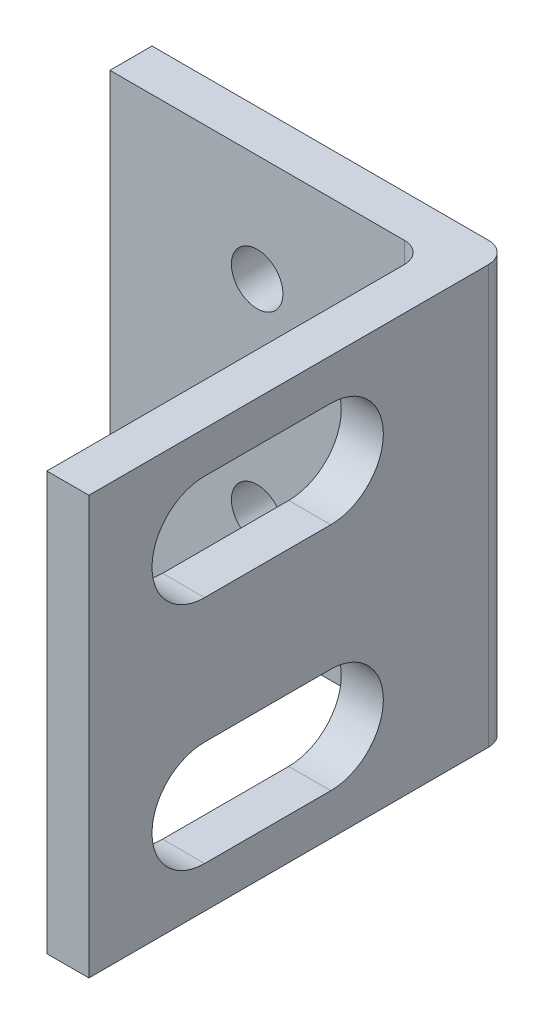
ISO-10303-21;
HEADER;
FILE_DESCRIPTION(('STEP AP214'),'2;1');
FILE_NAME('part.step','',(''),(''),'','','');
FILE_SCHEMA(('AUTOMOTIVE_DESIGN { 1 0 10303 214 1 1 1 1 }'));
ENDSEC;
DATA;
#1=APPLICATION_CONTEXT('core data for automotive mechanical design processes');
#2=APPLICATION_PROTOCOL_DEFINITION('international standard','automotive_design',2000,#1);
#3=PRODUCT_CONTEXT('',#1,'mechanical');
#4=PRODUCT('Part','Part','',(#3));
#5=PRODUCT_RELATED_PRODUCT_CATEGORY('part','',(#4));
#6=PRODUCT_DEFINITION_FORMATION('','',#4);
#7=PRODUCT_DEFINITION_CONTEXT('part definition',#1,'design');
#8=PRODUCT_DEFINITION('design','',#6,#7);
#9=PRODUCT_DEFINITION_SHAPE('','',#8);
#10=(LENGTH_UNIT() NAMED_UNIT(*) SI_UNIT(.MILLI.,.METRE.));
#11=(NAMED_UNIT(*) PLANE_ANGLE_UNIT() SI_UNIT($,.RADIAN.));
#12=(NAMED_UNIT(*) SI_UNIT($,.STERADIAN.) SOLID_ANGLE_UNIT());
#13=UNCERTAINTY_MEASURE_WITH_UNIT(LENGTH_MEASURE(1.E-05),#10,'distance_accuracy_value','');
#14=(GEOMETRIC_REPRESENTATION_CONTEXT(3) GLOBAL_UNCERTAINTY_ASSIGNED_CONTEXT((#13)) GLOBAL_UNIT_ASSIGNED_CONTEXT((#10,
#11,#12)) REPRESENTATION_CONTEXT('',''));
#15=CARTESIAN_POINT('',(0.,0.,0.));
#16=DIRECTION('',(0.,0.,1.));
#17=DIRECTION('',(1.,0.,0.));
#18=AXIS2_PLACEMENT_3D('',#15,#16,#17);
#19=CARTESIAN_POINT('',(1.31162466780544,19.88,0.));
#20=DIRECTION('',(1.,0.,0.));
#21=DIRECTION('',(0.,0.,-1.));
#22=AXIS2_PLACEMENT_3D('',#19,#20,#21);
#23=PLANE('',#22);
#24=CARTESIAN_POINT('',(1.31162466780544,15.4153869381785,-3.84005449659987));
#25=DIRECTION('',(-1.,0.,0.));
#26=DIRECTION('',(0.,0.,1.));
#27=AXIS2_PLACEMENT_3D('',#24,#25,#26);
#28=CIRCLE('',#27,2.5);
#29=CARTESIAN_POINT('',(1.31162466780544,17.9153869381785,-3.84005449659987));
#30=VERTEX_POINT('',#29);
#31=CARTESIAN_POINT('',(1.31162466780544,12.9153869381785,-3.84005449659987));
#32=VERTEX_POINT('',#31);
#33=EDGE_CURVE('E152',#30,#32,#28,.T.);
#34=ORIENTED_EDGE('',*,*,#33,.T.);
#35=DIRECTION('',(0.,0.,1.));
#36=VECTOR('',#35,1.);
#37=CARTESIAN_POINT('',(1.31162466780544,12.9153869381785,0.));
#38=LINE('',#37,#36);
#39=CARTESIAN_POINT('',(1.31162466780544,12.9153869381785,2.15994550340013));
#40=VERTEX_POINT('',#39);
#41=EDGE_CURVE('E163',#32,#40,#38,.T.);
#42=ORIENTED_EDGE('',*,*,#41,.T.);
#43=CARTESIAN_POINT('',(1.31162466780544,15.4153869381785,2.15994550340013));
#44=DIRECTION('',(-1.,0.,0.));
#45=DIRECTION('',(0.,0.,1.));
#46=AXIS2_PLACEMENT_3D('',#43,#44,#45);
#47=CIRCLE('',#46,2.5);
#48=CARTESIAN_POINT('',(1.31162466780544,17.9153869381785,2.15994550340013));
#49=VERTEX_POINT('',#48);
#50=EDGE_CURVE('E49',#40,#49,#47,.T.);
#51=ORIENTED_EDGE('',*,*,#50,.T.);
#52=DIRECTION('',(0.,0.,1.));
#53=VECTOR('',#52,1.);
#54=CARTESIAN_POINT('',(1.31162466780544,17.9153869381785,0.));
#55=LINE('',#54,#53);
#56=EDGE_CURVE('E160',#30,#49,#55,.T.);
#57=ORIENTED_EDGE('',*,*,#56,.F.);
#58=EDGE_LOOP('',(#34,#42,#51,#57));
#59=FACE_BOUND('',#58,.T.);
#60=DIRECTION('',(0.,0.,1.));
#61=VECTOR('',#60,1.);
#62=CARTESIAN_POINT('',(1.31162466780544,0.,0.));
#63=LINE('',#62,#61);
#64=CARTESIAN_POINT('',(1.31162466780544,0.,-11.3400544965999));
#65=VERTEX_POINT('',#64);
#66=CARTESIAN_POINT('',(1.31162466780544,0.,7.65994550340013));
#67=VERTEX_POINT('',#66);
#68=EDGE_CURVE('E219',#65,#67,#63,.T.);
#69=ORIENTED_EDGE('',*,*,#68,.F.);
#70=DIRECTION('',(0.,-1.,0.));
#71=VECTOR('',#70,1.);
#72=CARTESIAN_POINT('',(1.31162466780544,19.88,-11.3400544965999));
#73=LINE('',#72,#71);
#74=CARTESIAN_POINT('',(1.31162466780544,19.88,-11.3400544965999));
#75=VERTEX_POINT('',#74);
#76=EDGE_CURVE('E11',#75,#65,#73,.T.);
#77=ORIENTED_EDGE('',*,*,#76,.F.);
#78=DIRECTION('',(0.,0.,1.));
#79=VECTOR('',#78,1.);
#80=CARTESIAN_POINT('',(1.31162466780544,19.88,0.));
#81=LINE('',#80,#79);
#82=CARTESIAN_POINT('',(1.31162466780544,19.88,7.65994550340013));
#83=VERTEX_POINT('',#82);
#84=EDGE_CURVE('E228',#75,#83,#81,.T.);
#85=ORIENTED_EDGE('',*,*,#84,.T.);
#86=DIRECTION('',(0.,-1.,0.));
#87=VECTOR('',#86,1.);
#88=CARTESIAN_POINT('',(1.31162466780544,19.88,7.65994550340013));
#89=LINE('',#88,#87);
#90=EDGE_CURVE('E249',#83,#67,#89,.T.);
#91=ORIENTED_EDGE('',*,*,#90,.T.);
#92=EDGE_LOOP('',(#69,#77,#85,#91));
#93=FACE_BOUND('',#92,.T.);
#94=DIRECTION('',(0.,0.,1.));
#95=VECTOR('',#94,1.);
#96=CARTESIAN_POINT('',(1.31162466780544,6.96461306182154,0.));
#97=LINE('',#96,#95);
#98=CARTESIAN_POINT('',(1.31162466780544,6.96461306182154,-3.84005449659987));
#99=VERTEX_POINT('',#98);
#100=CARTESIAN_POINT('',(1.31162466780544,6.96461306182153,2.15994550340013));
#101=VERTEX_POINT('',#100);
#102=EDGE_CURVE('E196',#99,#101,#97,.T.);
#103=ORIENTED_EDGE('',*,*,#102,.F.);
#104=CARTESIAN_POINT('',(1.31162466780544,4.46461306182154,-3.84005449659987));
#105=DIRECTION('',(-1.,0.,0.));
#106=DIRECTION('',(0.,0.,1.));
#107=AXIS2_PLACEMENT_3D('',#104,#105,#106);
#108=CIRCLE('',#107,2.5);
#109=CARTESIAN_POINT('',(1.31162466780544,1.96461306182153,-3.84005449659987));
#110=VERTEX_POINT('',#109);
#111=EDGE_CURVE('E188',#110,#99,#108,.F.);
#112=ORIENTED_EDGE('',*,*,#111,.F.);
#113=DIRECTION('',(0.,0.,1.));
#114=VECTOR('',#113,1.);
#115=CARTESIAN_POINT('',(1.31162466780544,1.96461306182153,0.));
#116=LINE('',#115,#114);
#117=CARTESIAN_POINT('',(1.31162466780544,1.96461306182153,2.15994550340013));
#118=VERTEX_POINT('',#117);
#119=EDGE_CURVE('E190',#110,#118,#116,.T.);
#120=ORIENTED_EDGE('',*,*,#119,.T.);
#121=CARTESIAN_POINT('',(1.31162466780544,4.46461306182154,2.15994550340013));
#122=DIRECTION('',(-1.,0.,0.));
#123=DIRECTION('',(0.,0.,1.));
#124=AXIS2_PLACEMENT_3D('',#121,#122,#123);
#125=CIRCLE('',#124,2.5);
#126=EDGE_CURVE('E194',#101,#118,#125,.F.);
#127=ORIENTED_EDGE('',*,*,#126,.F.);
#128=EDGE_LOOP('',(#103,#112,#120,#127));
#129=FACE_BOUND('',#128,.T.);
#130=ADVANCED_FACE('F35',(#59,#93,#129),#23,.T.);
#131=CARTESIAN_POINT('',(-0.688375332194558,19.88,0.));
#132=DIRECTION('',(1.,0.,0.));
#133=DIRECTION('',(0.,0.,-1.));
#134=AXIS2_PLACEMENT_3D('',#131,#132,#133);
#135=PLANE('',#134);
#136=DIRECTION('',(0.,0.,1.));
#137=VECTOR('',#136,1.);
#138=CARTESIAN_POINT('',(-0.688375332194558,12.9153869381785,0.));
#139=LINE('',#138,#137);
#140=CARTESIAN_POINT('',(-0.688375332194558,12.9153869381785,-3.84005449659987));
#141=VERTEX_POINT('',#140);
#142=CARTESIAN_POINT('',(-0.688375332194558,12.9153869381785,2.15994550340013));
#143=VERTEX_POINT('',#142);
#144=EDGE_CURVE('E177',#141,#143,#139,.T.);
#145=ORIENTED_EDGE('',*,*,#144,.F.);
#146=CARTESIAN_POINT('',(-0.688375332194558,15.4153869381785,-3.84005449659987));
#147=DIRECTION('',(-1.,0.,0.));
#148=DIRECTION('',(0.,0.,1.));
#149=AXIS2_PLACEMENT_3D('',#146,#147,#148);
#150=CIRCLE('',#149,2.5);
#151=CARTESIAN_POINT('',(-0.688375332194558,17.9153869381785,-3.84005449659987));
#152=VERTEX_POINT('',#151);
#153=EDGE_CURVE('E155',#152,#141,#150,.T.);
#154=ORIENTED_EDGE('',*,*,#153,.F.);
#155=DIRECTION('',(0.,0.,1.));
#156=VECTOR('',#155,1.);
#157=CARTESIAN_POINT('',(-0.688375332194558,17.9153869381785,0.));
#158=LINE('',#157,#156);
#159=CARTESIAN_POINT('',(-0.688375332194558,17.9153869381785,2.15994550340013));
#160=VERTEX_POINT('',#159);
#161=EDGE_CURVE('E168',#152,#160,#158,.T.);
#162=ORIENTED_EDGE('',*,*,#161,.T.);
#163=CARTESIAN_POINT('',(-0.688375332194558,15.4153869381785,2.15994550340013));
#164=DIRECTION('',(-1.,0.,0.));
#165=DIRECTION('',(0.,0.,1.));
#166=AXIS2_PLACEMENT_3D('',#163,#164,#165);
#167=CIRCLE('',#166,2.5);
#168=EDGE_CURVE('E171',#143,#160,#167,.T.);
#169=ORIENTED_EDGE('',*,*,#168,.F.);
#170=EDGE_LOOP('',(#145,#154,#162,#169));
#171=FACE_BOUND('',#170,.T.);
#172=DIRECTION('',(0.,0.,1.));
#173=VECTOR('',#172,1.);
#174=CARTESIAN_POINT('',(-0.688375332194558,0.,0.));
#175=LINE('',#174,#173);
#176=CARTESIAN_POINT('',(-0.688375332194559,0.,-9.34005449659987));
#177=VERTEX_POINT('',#176);
#178=CARTESIAN_POINT('',(-0.688375332194557,0.,7.65994550340013));
#179=VERTEX_POINT('',#178);
#180=EDGE_CURVE('E267',#177,#179,#175,.T.);
#181=ORIENTED_EDGE('',*,*,#180,.T.);
#182=DIRECTION('',(0.,-1.,0.));
#183=VECTOR('',#182,1.);
#184=CARTESIAN_POINT('',(-0.688375332194557,19.88,7.65994550340013));
#185=LINE('',#184,#183);
#186=CARTESIAN_POINT('',(-0.688375332194557,19.88,7.65994550340013));
#187=VERTEX_POINT('',#186);
#188=EDGE_CURVE('E272',#187,#179,#185,.T.);
#189=ORIENTED_EDGE('',*,*,#188,.F.);
#190=DIRECTION('',(0.,0.,1.));
#191=VECTOR('',#190,1.);
#192=CARTESIAN_POINT('',(-0.688375332194558,19.88,0.));
#193=LINE('',#192,#191);
#194=CARTESIAN_POINT('',(-0.688375332194559,19.88,-9.34005449659987));
#195=VERTEX_POINT('',#194);
#196=EDGE_CURVE('E245',#195,#187,#193,.T.);
#197=ORIENTED_EDGE('',*,*,#196,.F.);
#198=DIRECTION('',(0.,-1.,0.));
#199=VECTOR('',#198,1.);
#200=CARTESIAN_POINT('',(-0.688375332194559,19.88,-9.34005449659987));
#201=LINE('',#200,#199);
#202=EDGE_CURVE('E275',#195,#177,#201,.T.);
#203=ORIENTED_EDGE('',*,*,#202,.T.);
#204=EDGE_LOOP('',(#181,#189,#197,#203));
#205=FACE_BOUND('',#204,.T.);
#206=CARTESIAN_POINT('',(-0.688375332194558,4.46461306182154,-3.84005449659987));
#207=DIRECTION('',(-1.,0.,0.));
#208=DIRECTION('',(0.,0.,1.));
#209=AXIS2_PLACEMENT_3D('',#206,#207,#208);
#210=CIRCLE('',#209,2.5);
#211=CARTESIAN_POINT('',(-0.688375332194558,1.96461306182153,-3.84005449659987));
#212=VERTEX_POINT('',#211);
#213=CARTESIAN_POINT('',(-0.688375332194558,6.96461306182154,-3.84005449659987));
#214=VERTEX_POINT('',#213);
#215=EDGE_CURVE('E199',#212,#214,#210,.F.);
#216=ORIENTED_EDGE('',*,*,#215,.T.);
#217=DIRECTION('',(0.,0.,1.));
#218=VECTOR('',#217,1.);
#219=CARTESIAN_POINT('',(-0.688375332194558,6.96461306182154,0.));
#220=LINE('',#219,#218);
#221=CARTESIAN_POINT('',(-0.688375332194558,6.96461306182153,2.15994550340013));
#222=VERTEX_POINT('',#221);
#223=EDGE_CURVE('E191',#214,#222,#220,.T.);
#224=ORIENTED_EDGE('',*,*,#223,.T.);
#225=CARTESIAN_POINT('',(-0.688375332194558,4.46461306182154,2.15994550340013));
#226=DIRECTION('',(-1.,0.,0.));
#227=DIRECTION('',(0.,0.,1.));
#228=AXIS2_PLACEMENT_3D('',#225,#226,#227);
#229=CIRCLE('',#228,2.5);
#230=CARTESIAN_POINT('',(-0.688375332194558,1.96461306182154,2.15994550340013));
#231=VERTEX_POINT('',#230);
#232=EDGE_CURVE('E204',#222,#231,#229,.F.);
#233=ORIENTED_EDGE('',*,*,#232,.T.);
#234=DIRECTION('',(0.,0.,1.));
#235=VECTOR('',#234,1.);
#236=CARTESIAN_POINT('',(-0.688375332194558,1.96461306182153,0.));
#237=LINE('',#236,#235);
#238=EDGE_CURVE('E202',#212,#231,#237,.T.);
#239=ORIENTED_EDGE('',*,*,#238,.F.);
#240=EDGE_LOOP('',(#216,#224,#233,#239));
#241=FACE_BOUND('',#240,.T.);
#242=ADVANCED_FACE('F315',(#171,#205,#241),#135,.F.);
#243=CARTESIAN_POINT('',(0.311624667805443,19.88,-11.3400544965999));
#244=DIRECTION('',(0.,-1.,0.));
#245=DIRECTION('',(0.,0.,-1.));
#246=AXIS2_PLACEMENT_3D('',#243,#244,#245);
#247=CYLINDRICAL_SURFACE('',#246,1.);
#248=CARTESIAN_POINT('',(0.311624667805443,0.,-11.3400544965999));
#249=DIRECTION('',(0.,1.,0.));
#250=DIRECTION('',(0.,0.,1.));
#251=AXIS2_PLACEMENT_3D('',#248,#249,#250);
#252=CIRCLE('',#251,1.);
#253=CARTESIAN_POINT('',(0.311624667805443,0.,-12.3400544965999));
#254=VERTEX_POINT('',#253);
#255=EDGE_CURVE('E252',#65,#254,#252,.T.);
#256=ORIENTED_EDGE('',*,*,#255,.T.);
#257=DIRECTION('',(0.,-1.,0.));
#258=VECTOR('',#257,1.);
#259=CARTESIAN_POINT('',(0.311624667805443,19.88,-12.3400544965999));
#260=LINE('',#259,#258);
#261=CARTESIAN_POINT('',(0.311624667805443,19.88,-12.3400544965999));
#262=VERTEX_POINT('',#261);
#263=EDGE_CURVE('E42',#262,#254,#260,.T.);
#264=ORIENTED_EDGE('',*,*,#263,.F.);
#265=CARTESIAN_POINT('',(0.311624667805443,19.88,-11.3400544965999));
#266=DIRECTION('',(0.,1.,0.));
#267=DIRECTION('',(0.,0.,1.));
#268=AXIS2_PLACEMENT_3D('',#265,#266,#267);
#269=CIRCLE('',#268,1.);
#270=EDGE_CURVE('E231',#75,#262,#269,.T.);
#271=ORIENTED_EDGE('',*,*,#270,.F.);
#272=ORIENTED_EDGE('',*,*,#76,.T.);
#273=EDGE_LOOP('',(#256,#264,#271,#272));
#274=FACE_BOUND('',#273,.T.);
#275=ADVANCED_FACE('F290',(#274),#247,.T.);
#276=CARTESIAN_POINT('',(0.,19.88,-12.3400544965999));
#277=DIRECTION('',(0.,0.,-1.));
#278=DIRECTION('',(-1.,0.,0.));
#279=AXIS2_PLACEMENT_3D('',#276,#277,#278);
#280=PLANE('',#279);
#281=CARTESIAN_POINT('',(-8.68837533219456,5.095,-12.3400544965999));
#282=DIRECTION('',(0.,0.,1.));
#283=DIRECTION('',(1.,0.,0.));
#284=AXIS2_PLACEMENT_3D('',#281,#282,#283);
#285=CIRCLE('',#284,1.225);
#286=CARTESIAN_POINT('',(-7.46337533219456,5.095,-12.3400544965999));
#287=VERTEX_POINT('',#286);
#288=EDGE_CURVE('E216',#287,#287,#285,.T.);
#289=ORIENTED_EDGE('',*,*,#288,.T.);
#290=EDGE_LOOP('',(#289));
#291=FACE_BOUND('',#290,.T.);
#292=CARTESIAN_POINT('',(-8.68837533219457,14.785,-12.3400544965999));
#293=DIRECTION('',(0.,0.,1.));
#294=DIRECTION('',(-1.,0.,0.));
#295=AXIS2_PLACEMENT_3D('',#292,#293,#294);
#296=CIRCLE('',#295,1.225);
#297=CARTESIAN_POINT('',(-9.91337533219457,14.785,-12.3400544965999));
#298=VERTEX_POINT('',#297);
#299=EDGE_CURVE('E223',#298,#298,#296,.T.);
#300=ORIENTED_EDGE('',*,*,#299,.T.);
#301=EDGE_LOOP('',(#300));
#302=FACE_BOUND('',#301,.T.);
#303=DIRECTION('',(1.,0.,0.));
#304=VECTOR('',#303,1.);
#305=CARTESIAN_POINT('',(0.,0.,-12.3400544965999));
#306=LINE('',#305,#304);
#307=CARTESIAN_POINT('',(-15.6883753321946,0.,-12.3400544965999));
#308=VERTEX_POINT('',#307);
#309=EDGE_CURVE('E255',#308,#254,#306,.T.);
#310=ORIENTED_EDGE('',*,*,#309,.F.);
#311=DIRECTION('',(0.,-1.,0.));
#312=VECTOR('',#311,1.);
#313=CARTESIAN_POINT('',(-15.6883753321946,19.88,-12.3400544965999));
#314=LINE('',#313,#312);
#315=CARTESIAN_POINT('',(-15.6883753321946,19.88,-12.3400544965999));
#316=VERTEX_POINT('',#315);
#317=EDGE_CURVE('E281',#316,#308,#314,.T.);
#318=ORIENTED_EDGE('',*,*,#317,.F.);
#319=DIRECTION('',(1.,0.,0.));
#320=VECTOR('',#319,1.);
#321=CARTESIAN_POINT('',(0.,19.88,-12.3400544965999));
#322=LINE('',#321,#320);
#323=EDGE_CURVE('E234',#316,#262,#322,.T.);
#324=ORIENTED_EDGE('',*,*,#323,.T.);
#325=ORIENTED_EDGE('',*,*,#263,.T.);
#326=EDGE_LOOP('',(#310,#318,#324,#325));
#327=FACE_BOUND('',#326,.T.);
#328=ADVANCED_FACE('F285',(#291,#302,#327),#280,.T.);
#329=CARTESIAN_POINT('',(-15.6883753321946,19.88,0.));
#330=DIRECTION('',(1.,0.,0.));
#331=DIRECTION('',(0.,0.,-1.));
#332=AXIS2_PLACEMENT_3D('',#329,#330,#331);
#333=PLANE('',#332);
#334=DIRECTION('',(0.,0.,1.));
#335=VECTOR('',#334,1.);
#336=CARTESIAN_POINT('',(-15.6883753321946,0.,0.));
#337=LINE('',#336,#335);
#338=CARTESIAN_POINT('',(-15.6883753321946,0.,-10.3400544965999));
#339=VERTEX_POINT('',#338);
#340=EDGE_CURVE('E258',#308,#339,#337,.T.);
#341=ORIENTED_EDGE('',*,*,#340,.T.);
#342=DIRECTION('',(0.,-1.,0.));
#343=VECTOR('',#342,1.);
#344=CARTESIAN_POINT('',(-15.6883753321946,19.88,-10.3400544965999));
#345=LINE('',#344,#343);
#346=CARTESIAN_POINT('',(-15.6883753321946,19.88,-10.3400544965999));
#347=VERTEX_POINT('',#346);
#348=EDGE_CURVE('E279',#347,#339,#345,.T.);
#349=ORIENTED_EDGE('',*,*,#348,.F.);
#350=DIRECTION('',(0.,0.,1.));
#351=VECTOR('',#350,1.);
#352=CARTESIAN_POINT('',(-15.6883753321946,19.88,0.));
#353=LINE('',#352,#351);
#354=EDGE_CURVE('E237',#316,#347,#353,.T.);
#355=ORIENTED_EDGE('',*,*,#354,.F.);
#356=ORIENTED_EDGE('',*,*,#317,.T.);
#357=EDGE_LOOP('',(#341,#349,#355,#356));
#358=FACE_BOUND('',#357,.T.);
#359=ADVANCED_FACE('F298',(#358),#333,.F.);
#360=CARTESIAN_POINT('',(0.,19.88,-10.3400544965999));
#361=DIRECTION('',(0.,0.,1.));
#362=DIRECTION('',(1.,0.,0.));
#363=AXIS2_PLACEMENT_3D('',#360,#361,#362);
#364=PLANE('',#363);
#365=CARTESIAN_POINT('',(-8.68837533219456,5.095,-10.3400544965999));
#366=DIRECTION('',(0.,0.,1.));
#367=DIRECTION('',(1.,0.,0.));
#368=AXIS2_PLACEMENT_3D('',#365,#366,#367);
#369=CIRCLE('',#368,1.225);
#370=CARTESIAN_POINT('',(-7.46337533219456,5.095,-10.3400544965999));
#371=VERTEX_POINT('',#370);
#372=EDGE_CURVE('E220',#371,#371,#369,.T.);
#373=ORIENTED_EDGE('',*,*,#372,.F.);
#374=EDGE_LOOP('',(#373));
#375=FACE_BOUND('',#374,.T.);
#376=CARTESIAN_POINT('',(-8.68837533219457,14.785,-10.3400544965999));
#377=DIRECTION('',(0.,0.,1.));
#378=DIRECTION('',(-1.,0.,0.));
#379=AXIS2_PLACEMENT_3D('',#376,#377,#378);
#380=CIRCLE('',#379,1.225);
#381=CARTESIAN_POINT('',(-9.91337533219457,14.785,-10.3400544965999));
#382=VERTEX_POINT('',#381);
#383=EDGE_CURVE('E184',#382,#382,#380,.T.);
#384=ORIENTED_EDGE('',*,*,#383,.F.);
#385=EDGE_LOOP('',(#384));
#386=FACE_BOUND('',#385,.T.);
#387=DIRECTION('',(-1.,0.,0.));
#388=VECTOR('',#387,1.);
#389=CARTESIAN_POINT('',(0.,0.,-10.3400544965999));
#390=LINE('',#389,#388);
#391=CARTESIAN_POINT('',(-1.68837533219456,0.,-10.3400544965999));
#392=VERTEX_POINT('',#391);
#393=EDGE_CURVE('E261',#392,#339,#390,.T.);
#394=ORIENTED_EDGE('',*,*,#393,.F.);
#395=DIRECTION('',(0.,-1.,0.));
#396=VECTOR('',#395,1.);
#397=CARTESIAN_POINT('',(-1.68837533219456,19.88,-10.3400544965999));
#398=LINE('',#397,#396);
#399=CARTESIAN_POINT('',(-1.68837533219456,19.88,-10.3400544965999));
#400=VERTEX_POINT('',#399);
#401=EDGE_CURVE('E277',#400,#392,#398,.T.);
#402=ORIENTED_EDGE('',*,*,#401,.F.);
#403=DIRECTION('',(-1.,0.,0.));
#404=VECTOR('',#403,1.);
#405=CARTESIAN_POINT('',(0.,19.88,-10.3400544965999));
#406=LINE('',#405,#404);
#407=EDGE_CURVE('E239',#400,#347,#406,.T.);
#408=ORIENTED_EDGE('',*,*,#407,.T.);
#409=ORIENTED_EDGE('',*,*,#348,.T.);
#410=EDGE_LOOP('',(#394,#402,#408,#409));
#411=FACE_BOUND('',#410,.T.);
#412=ADVANCED_FACE('F321',(#375,#386,#411),#364,.T.);
#413=CARTESIAN_POINT('',(-1.68837533219456,19.88,-9.34005449659987));
#414=DIRECTION('',(0.,-1.,0.));
#415=DIRECTION('',(0.,0.,-1.));
#416=AXIS2_PLACEMENT_3D('',#413,#414,#415);
#417=CYLINDRICAL_SURFACE('',#416,1.);
#418=CARTESIAN_POINT('',(-1.68837533219456,0.,-9.34005449659987));
#419=DIRECTION('',(0.,1.,0.));
#420=DIRECTION('',(0.,0.,1.));
#421=AXIS2_PLACEMENT_3D('',#418,#419,#420);
#422=CIRCLE('',#421,1.);
#423=EDGE_CURVE('E264',#177,#392,#422,.T.);
#424=ORIENTED_EDGE('',*,*,#423,.F.);
#425=ORIENTED_EDGE('',*,*,#202,.F.);
#426=CARTESIAN_POINT('',(-1.68837533219456,19.88,-9.34005449659987));
#427=DIRECTION('',(0.,1.,0.));
#428=DIRECTION('',(0.,0.,1.));
#429=AXIS2_PLACEMENT_3D('',#426,#427,#428);
#430=CIRCLE('',#429,1.);
#431=EDGE_CURVE('E242',#195,#400,#430,.T.);
#432=ORIENTED_EDGE('',*,*,#431,.T.);
#433=ORIENTED_EDGE('',*,*,#401,.T.);
#434=EDGE_LOOP('',(#424,#425,#432,#433));
#435=FACE_BOUND('',#434,.T.);
#436=ADVANCED_FACE('F319',(#435),#417,.F.);
#437=CARTESIAN_POINT('',(0.,19.88,7.65994550340013));
#438=DIRECTION('',(0.,0.,-1.));
#439=DIRECTION('',(-1.,0.,0.));
#440=AXIS2_PLACEMENT_3D('',#437,#438,#439);
#441=PLANE('',#440);
#442=DIRECTION('',(1.,0.,0.));
#443=VECTOR('',#442,1.);
#444=CARTESIAN_POINT('',(0.,0.,7.65994550340013));
#445=LINE('',#444,#443);
#446=EDGE_CURVE('E232',#179,#67,#445,.T.);
#447=ORIENTED_EDGE('',*,*,#446,.T.);
#448=ORIENTED_EDGE('',*,*,#90,.F.);
#449=DIRECTION('',(1.,0.,0.));
#450=VECTOR('',#449,1.);
#451=CARTESIAN_POINT('',(0.,19.88,7.65994550340013));
#452=LINE('',#451,#450);
#453=EDGE_CURVE('E247',#187,#83,#452,.T.);
#454=ORIENTED_EDGE('',*,*,#453,.F.);
#455=ORIENTED_EDGE('',*,*,#188,.T.);
#456=EDGE_LOOP('',(#447,#448,#454,#455));
#457=FACE_BOUND('',#456,.T.);
#458=ADVANCED_FACE('F311',(#457),#441,.F.);
#459=CARTESIAN_POINT('',(0.,19.88,0.));
#460=DIRECTION('',(0.,1.,0.));
#461=DIRECTION('',(0.,0.,1.));
#462=AXIS2_PLACEMENT_3D('',#459,#460,#461);
#463=PLANE('',#462);
#464=ORIENTED_EDGE('',*,*,#84,.F.);
#465=ORIENTED_EDGE('',*,*,#270,.T.);
#466=ORIENTED_EDGE('',*,*,#323,.F.);
#467=ORIENTED_EDGE('',*,*,#354,.T.);
#468=ORIENTED_EDGE('',*,*,#407,.F.);
#469=ORIENTED_EDGE('',*,*,#431,.F.);
#470=ORIENTED_EDGE('',*,*,#196,.T.);
#471=ORIENTED_EDGE('',*,*,#453,.T.);
#472=EDGE_LOOP('',(#464,#465,#466,#467,#468,#469,#470,#471));
#473=FACE_BOUND('',#472,.T.);
#474=ADVANCED_FACE('F303',(#473),#463,.T.);
#475=CARTESIAN_POINT('',(0.,0.,0.));
#476=DIRECTION('',(0.,1.,0.));
#477=DIRECTION('',(0.,0.,1.));
#478=AXIS2_PLACEMENT_3D('',#475,#476,#477);
#479=PLANE('',#478);
#480=ORIENTED_EDGE('',*,*,#68,.T.);
#481=ORIENTED_EDGE('',*,*,#446,.F.);
#482=ORIENTED_EDGE('',*,*,#180,.F.);
#483=ORIENTED_EDGE('',*,*,#423,.T.);
#484=ORIENTED_EDGE('',*,*,#393,.T.);
#485=ORIENTED_EDGE('',*,*,#340,.F.);
#486=ORIENTED_EDGE('',*,*,#309,.T.);
#487=ORIENTED_EDGE('',*,*,#255,.F.);
#488=EDGE_LOOP('',(#480,#481,#482,#483,#484,#485,#486,#487));
#489=FACE_BOUND('',#488,.T.);
#490=ADVANCED_FACE('F294',(#489),#479,.F.);
#491=CARTESIAN_POINT('',(-8.68837533219457,14.785,-12.3400544965999));
#492=DIRECTION('',(0.,0.,1.));
#493=DIRECTION('',(1.,0.,0.));
#494=AXIS2_PLACEMENT_3D('',#491,#492,#493);
#495=CYLINDRICAL_SURFACE('',#494,1.225);
#496=ORIENTED_EDGE('',*,*,#299,.F.);
#497=EDGE_LOOP('',(#496));
#498=FACE_BOUND('',#497,.T.);
#499=ORIENTED_EDGE('',*,*,#383,.T.);
#500=EDGE_LOOP('',(#499));
#501=FACE_BOUND('',#500,.T.);
#502=ADVANCED_FACE('F347',(#498,#501),#495,.F.);
#503=CARTESIAN_POINT('',(-8.68837533219456,5.095,-12.3400544965999));
#504=DIRECTION('',(0.,0.,1.));
#505=DIRECTION('',(1.,0.,0.));
#506=AXIS2_PLACEMENT_3D('',#503,#504,#505);
#507=CYLINDRICAL_SURFACE('',#506,1.225);
#508=ORIENTED_EDGE('',*,*,#288,.F.);
#509=EDGE_LOOP('',(#508));
#510=FACE_BOUND('',#509,.T.);
#511=ORIENTED_EDGE('',*,*,#372,.T.);
#512=EDGE_LOOP('',(#511));
#513=FACE_BOUND('',#512,.T.);
#514=ADVANCED_FACE('F352',(#510,#513),#507,.F.);
#515=CARTESIAN_POINT('',(1.31162466780544,4.46461306182154,-3.84005449659987));
#516=DIRECTION('',(-1.,0.,0.));
#517=DIRECTION('',(0.,0.,1.));
#518=AXIS2_PLACEMENT_3D('',#515,#516,#517);
#519=CYLINDRICAL_SURFACE('',#518,2.5);
#520=ORIENTED_EDGE('',*,*,#215,.F.);
#521=DIRECTION('',(-1.,0.,0.));
#522=VECTOR('',#521,1.);
#523=CARTESIAN_POINT('',(1.31162466780544,1.96461306182153,-3.84005449659987));
#524=LINE('',#523,#522);
#525=EDGE_CURVE('E198',#110,#212,#524,.T.);
#526=ORIENTED_EDGE('',*,*,#525,.F.);
#527=ORIENTED_EDGE('',*,*,#111,.T.);
#528=DIRECTION('',(-1.,0.,0.));
#529=VECTOR('',#528,1.);
#530=CARTESIAN_POINT('',(1.31162466780544,6.96461306182154,-3.84005449659987));
#531=LINE('',#530,#529);
#532=EDGE_CURVE('E178',#99,#214,#531,.T.);
#533=ORIENTED_EDGE('',*,*,#532,.T.);
#534=EDGE_LOOP('',(#520,#526,#527,#533));
#535=FACE_BOUND('',#534,.T.);
#536=ADVANCED_FACE('F356',(#535),#519,.F.);
#537=CARTESIAN_POINT('',(1.31162466780544,6.96461306182154,0.));
#538=DIRECTION('',(0.,-1.,0.));
#539=DIRECTION('',(0.,0.,-1.));
#540=AXIS2_PLACEMENT_3D('',#537,#538,#539);
#541=PLANE('',#540);
#542=ORIENTED_EDGE('',*,*,#223,.F.);
#543=ORIENTED_EDGE('',*,*,#532,.F.);
#544=ORIENTED_EDGE('',*,*,#102,.T.);
#545=DIRECTION('',(-1.,0.,0.));
#546=VECTOR('',#545,1.);
#547=CARTESIAN_POINT('',(1.31162466780544,6.96461306182153,2.15994550340013));
#548=LINE('',#547,#546);
#549=EDGE_CURVE('E211',#101,#222,#548,.T.);
#550=ORIENTED_EDGE('',*,*,#549,.T.);
#551=EDGE_LOOP('',(#542,#543,#544,#550));
#552=FACE_BOUND('',#551,.T.);
#553=ADVANCED_FACE('F360',(#552),#541,.T.);
#554=CARTESIAN_POINT('',(1.31162466780544,4.46461306182154,2.15994550340013));
#555=DIRECTION('',(-1.,0.,0.));
#556=DIRECTION('',(0.,0.,1.));
#557=AXIS2_PLACEMENT_3D('',#554,#555,#556);
#558=CYLINDRICAL_SURFACE('',#557,2.5);
#559=ORIENTED_EDGE('',*,*,#232,.F.);
#560=ORIENTED_EDGE('',*,*,#549,.F.);
#561=ORIENTED_EDGE('',*,*,#126,.T.);
#562=DIRECTION('',(-1.,0.,0.));
#563=VECTOR('',#562,1.);
#564=CARTESIAN_POINT('',(1.31162466780544,1.96461306182154,2.15994550340013));
#565=LINE('',#564,#563);
#566=EDGE_CURVE('E57',#118,#231,#565,.T.);
#567=ORIENTED_EDGE('',*,*,#566,.T.);
#568=EDGE_LOOP('',(#559,#560,#561,#567));
#569=FACE_BOUND('',#568,.T.);
#570=ADVANCED_FACE('F365',(#569),#558,.F.);
#571=CARTESIAN_POINT('',(1.31162466780544,1.96461306182153,0.));
#572=DIRECTION('',(0.,-1.,0.));
#573=DIRECTION('',(0.,0.,-1.));
#574=AXIS2_PLACEMENT_3D('',#571,#572,#573);
#575=PLANE('',#574);
#576=ORIENTED_EDGE('',*,*,#238,.T.);
#577=ORIENTED_EDGE('',*,*,#566,.F.);
#578=ORIENTED_EDGE('',*,*,#119,.F.);
#579=ORIENTED_EDGE('',*,*,#525,.T.);
#580=EDGE_LOOP('',(#576,#577,#578,#579));
#581=FACE_BOUND('',#580,.T.);
#582=ADVANCED_FACE('F362',(#581),#575,.F.);
#583=CARTESIAN_POINT('',(1.31162466780544,15.4153869381785,-3.84005449659987));
#584=DIRECTION('',(-1.,0.,0.));
#585=DIRECTION('',(0.,0.,1.));
#586=AXIS2_PLACEMENT_3D('',#583,#584,#585);
#587=CYLINDRICAL_SURFACE('',#586,2.5);
#588=ORIENTED_EDGE('',*,*,#153,.T.);
#589=DIRECTION('',(-1.,0.,0.));
#590=VECTOR('',#589,1.);
#591=CARTESIAN_POINT('',(1.31162466780544,12.9153869381785,-3.84005449659987));
#592=LINE('',#591,#590);
#593=EDGE_CURVE('E148',#32,#141,#592,.T.);
#594=ORIENTED_EDGE('',*,*,#593,.F.);
#595=ORIENTED_EDGE('',*,*,#33,.F.);
#596=DIRECTION('',(-1.,0.,0.));
#597=VECTOR('',#596,1.);
#598=CARTESIAN_POINT('',(1.31162466780544,17.9153869381785,-3.84005449659987));
#599=LINE('',#598,#597);
#600=EDGE_CURVE('E182',#30,#152,#599,.T.);
#601=ORIENTED_EDGE('',*,*,#600,.T.);
#602=EDGE_LOOP('',(#588,#594,#595,#601));
#603=FACE_BOUND('',#602,.T.);
#604=ADVANCED_FACE('F150',(#603),#587,.F.);
#605=CARTESIAN_POINT('',(1.31162466780544,17.9153869381785,0.));
#606=DIRECTION('',(0.,-1.,0.));
#607=DIRECTION('',(0.,0.,-1.));
#608=AXIS2_PLACEMENT_3D('',#605,#606,#607);
#609=PLANE('',#608);
#610=ORIENTED_EDGE('',*,*,#161,.F.);
#611=ORIENTED_EDGE('',*,*,#600,.F.);
#612=ORIENTED_EDGE('',*,*,#56,.T.);
#613=DIRECTION('',(-1.,0.,0.));
#614=VECTOR('',#613,1.);
#615=CARTESIAN_POINT('',(1.31162466780544,17.9153869381785,2.15994550340013));
#616=LINE('',#615,#614);
#617=EDGE_CURVE('E185',#49,#160,#616,.T.);
#618=ORIENTED_EDGE('',*,*,#617,.T.);
#619=EDGE_LOOP('',(#610,#611,#612,#618));
#620=FACE_BOUND('',#619,.T.);
#621=ADVANCED_FACE('F374',(#620),#609,.T.);
#622=CARTESIAN_POINT('',(1.31162466780544,15.4153869381785,2.15994550340013));
#623=DIRECTION('',(-1.,0.,0.));
#624=DIRECTION('',(0.,0.,1.));
#625=AXIS2_PLACEMENT_3D('',#622,#623,#624);
#626=CYLINDRICAL_SURFACE('',#625,2.5);
#627=ORIENTED_EDGE('',*,*,#168,.T.);
#628=ORIENTED_EDGE('',*,*,#617,.F.);
#629=ORIENTED_EDGE('',*,*,#50,.F.);
#630=DIRECTION('',(-1.,0.,0.));
#631=VECTOR('',#630,1.);
#632=CARTESIAN_POINT('',(1.31162466780544,12.9153869381785,2.15994550340013));
#633=LINE('',#632,#631);
#634=EDGE_CURVE('E159',#40,#143,#633,.T.);
#635=ORIENTED_EDGE('',*,*,#634,.T.);
#636=EDGE_LOOP('',(#627,#628,#629,#635));
#637=FACE_BOUND('',#636,.T.);
#638=ADVANCED_FACE('F377',(#637),#626,.F.);
#639=CARTESIAN_POINT('',(1.31162466780544,12.9153869381785,0.));
#640=DIRECTION('',(0.,-1.,0.));
#641=DIRECTION('',(0.,0.,-1.));
#642=AXIS2_PLACEMENT_3D('',#639,#640,#641);
#643=PLANE('',#642);
#644=ORIENTED_EDGE('',*,*,#144,.T.);
#645=ORIENTED_EDGE('',*,*,#634,.F.);
#646=ORIENTED_EDGE('',*,*,#41,.F.);
#647=ORIENTED_EDGE('',*,*,#593,.T.);
#648=EDGE_LOOP('',(#644,#645,#646,#647));
#649=FACE_BOUND('',#648,.T.);
#650=ADVANCED_FACE('F164',(#649),#643,.F.);
#651=CLOSED_SHELL('',(#130,#242,#275,#328,#359,#412,#436,#458,#474,#490,#502,#514,#536,#553,
#570,#582,#604,#621,#638,#650));
#652=MANIFOLD_SOLID_BREP('B2',#651);
#653=ADVANCED_BREP_SHAPE_REPRESENTATION('',(#18,#652),#14);
#654=SHAPE_DEFINITION_REPRESENTATION(#9,#653);
ENDSEC;
END-ISO-10303-21;
